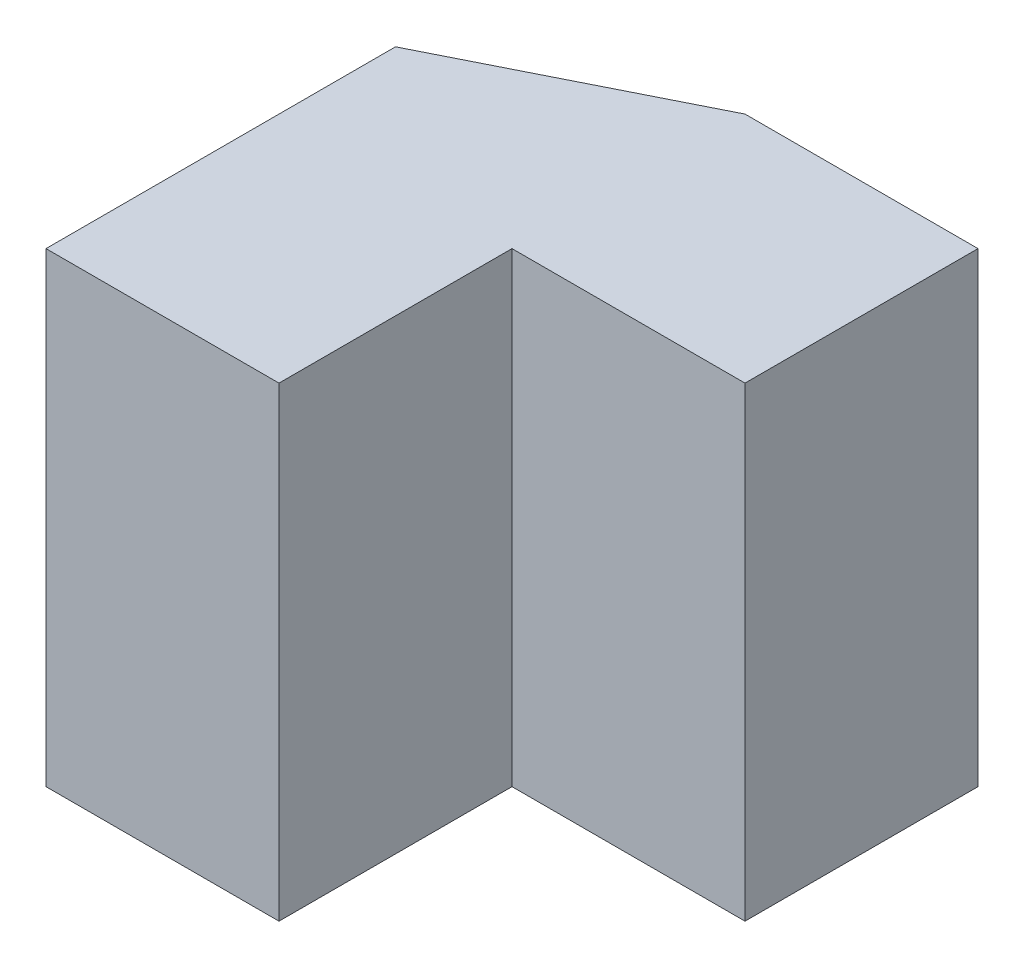
ISO-10303-21;
HEADER;
FILE_DESCRIPTION(('STEP AP214'),'2;1');
FILE_NAME('part.step','',(''),(''),'','','');
FILE_SCHEMA(('AUTOMOTIVE_DESIGN { 1 0 10303 214 1 1 1 1 }'));
ENDSEC;
DATA;
#1=APPLICATION_CONTEXT('core data for automotive mechanical design processes');
#2=APPLICATION_PROTOCOL_DEFINITION('international standard','automotive_design',2000,#1);
#3=PRODUCT_CONTEXT('',#1,'mechanical');
#4=PRODUCT('Part','Part','',(#3));
#5=PRODUCT_RELATED_PRODUCT_CATEGORY('part','',(#4));
#6=PRODUCT_DEFINITION_FORMATION('','',#4);
#7=PRODUCT_DEFINITION_CONTEXT('part definition',#1,'design');
#8=PRODUCT_DEFINITION('design','',#6,#7);
#9=PRODUCT_DEFINITION_SHAPE('','',#8);
#10=(LENGTH_UNIT() NAMED_UNIT(*) SI_UNIT(.MILLI.,.METRE.));
#11=(NAMED_UNIT(*) PLANE_ANGLE_UNIT() SI_UNIT($,.RADIAN.));
#12=(NAMED_UNIT(*) SI_UNIT($,.STERADIAN.) SOLID_ANGLE_UNIT());
#13=UNCERTAINTY_MEASURE_WITH_UNIT(LENGTH_MEASURE(1.E-05),#10,'distance_accuracy_value','');
#14=(GEOMETRIC_REPRESENTATION_CONTEXT(3) GLOBAL_UNCERTAINTY_ASSIGNED_CONTEXT((#13)) GLOBAL_UNIT_ASSIGNED_CONTEXT((#10,
#11,#12)) REPRESENTATION_CONTEXT('',''));
#15=CARTESIAN_POINT('',(0.,0.,0.));
#16=DIRECTION('',(0.,0.,1.));
#17=DIRECTION('',(1.,0.,0.));
#18=AXIS2_PLACEMENT_3D('',#15,#16,#17);
#19=CARTESIAN_POINT('',(0.,0.,20.));
#20=DIRECTION('',(1.,0.,0.));
#21=DIRECTION('',(0.,0.,-1.));
#22=AXIS2_PLACEMENT_3D('',#19,#20,#21);
#23=PLANE('',#22);
#24=DIRECTION('',(0.,0.,-1.));
#25=VECTOR('',#24,1.);
#26=CARTESIAN_POINT('',(0.,20.,20.));
#27=LINE('',#26,#25);
#28=CARTESIAN_POINT('',(0.,20.,20.));
#29=VERTEX_POINT('',#28);
#30=CARTESIAN_POINT('',(0.,20.,5.));
#31=VERTEX_POINT('',#30);
#32=EDGE_CURVE('E102',#29,#31,#27,.T.);
#33=ORIENTED_EDGE('',*,*,#32,.T.);
#34=DIRECTION('',(0.,1.,0.));
#35=VECTOR('',#34,1.);
#36=CARTESIAN_POINT('',(0.,0.,5.));
#37=LINE('',#36,#35);
#38=CARTESIAN_POINT('',(0.,0.,5.));
#39=VERTEX_POINT('',#38);
#40=EDGE_CURVE('E92',#39,#31,#37,.T.);
#41=ORIENTED_EDGE('',*,*,#40,.F.);
#42=DIRECTION('',(0.,0.,-1.));
#43=VECTOR('',#42,1.);
#44=CARTESIAN_POINT('',(0.,0.,20.));
#45=LINE('',#44,#43);
#46=CARTESIAN_POINT('',(0.,0.,20.));
#47=VERTEX_POINT('',#46);
#48=EDGE_CURVE('E11',#47,#39,#45,.T.);
#49=ORIENTED_EDGE('',*,*,#48,.F.);
#50=DIRECTION('',(0.,-1.,0.));
#51=VECTOR('',#50,1.);
#52=CARTESIAN_POINT('',(0.,0.,20.));
#53=LINE('',#52,#51);
#54=EDGE_CURVE('E114',#29,#47,#53,.T.);
#55=ORIENTED_EDGE('',*,*,#54,.F.);
#56=EDGE_LOOP('',(#33,#41,#49,#55));
#57=FACE_BOUND('',#56,.T.);
#58=ADVANCED_FACE('F33',(#57),#23,.F.);
#59=CARTESIAN_POINT('',(0.,0.,20.));
#60=DIRECTION('',(0.,1.,0.));
#61=DIRECTION('',(0.,0.,1.));
#62=AXIS2_PLACEMENT_3D('',#59,#60,#61);
#63=PLANE('',#62);
#64=ORIENTED_EDGE('',*,*,#48,.T.);
#65=DIRECTION('',(0.894427190999916,0.,-0.447213595499958));
#66=VECTOR('',#65,1.);
#67=CARTESIAN_POINT('',(10.,0.,0.));
#68=LINE('',#67,#66);
#69=CARTESIAN_POINT('',(10.,0.,0.));
#70=VERTEX_POINT('',#69);
#71=EDGE_CURVE('E89',#39,#70,#68,.T.);
#72=ORIENTED_EDGE('',*,*,#71,.T.);
#73=DIRECTION('',(1.,0.,0.));
#74=VECTOR('',#73,1.);
#75=CARTESIAN_POINT('',(0.,0.,0.));
#76=LINE('',#75,#74);
#77=CARTESIAN_POINT('',(20.,0.,0.));
#78=VERTEX_POINT('',#77);
#79=EDGE_CURVE('E128',#70,#78,#76,.T.);
#80=ORIENTED_EDGE('',*,*,#79,.T.);
#81=DIRECTION('',(0.,0.,-1.));
#82=VECTOR('',#81,1.);
#83=CARTESIAN_POINT('',(20.,0.,20.));
#84=LINE('',#83,#82);
#85=CARTESIAN_POINT('',(20.,0.,10.));
#86=VERTEX_POINT('',#85);
#87=EDGE_CURVE('E40',#86,#78,#84,.T.);
#88=ORIENTED_EDGE('',*,*,#87,.F.);
#89=DIRECTION('',(-1.,0.,0.));
#90=VECTOR('',#89,1.);
#91=CARTESIAN_POINT('',(20.,0.,10.));
#92=LINE('',#91,#90);
#93=CARTESIAN_POINT('',(10.,0.,10.));
#94=VERTEX_POINT('',#93);
#95=EDGE_CURVE('E152',#86,#94,#92,.T.);
#96=ORIENTED_EDGE('',*,*,#95,.T.);
#97=DIRECTION('',(0.,0.,1.));
#98=VECTOR('',#97,1.);
#99=CARTESIAN_POINT('',(10.,0.,20.));
#100=LINE('',#99,#98);
#101=CARTESIAN_POINT('',(10.,0.,20.));
#102=VERTEX_POINT('',#101);
#103=EDGE_CURVE('E111',#94,#102,#100,.T.);
#104=ORIENTED_EDGE('',*,*,#103,.T.);
#105=DIRECTION('',(1.,0.,0.));
#106=VECTOR('',#105,1.);
#107=CARTESIAN_POINT('',(0.,0.,20.));
#108=LINE('',#107,#106);
#109=EDGE_CURVE('E107',#47,#102,#108,.T.);
#110=ORIENTED_EDGE('',*,*,#109,.F.);
#111=EDGE_LOOP('',(#64,#72,#80,#88,#96,#104,#110));
#112=FACE_BOUND('',#111,.T.);
#113=ADVANCED_FACE('F104',(#112),#63,.F.);
#114=CARTESIAN_POINT('',(20.,0.,20.));
#115=DIRECTION('',(-1.,0.,0.));
#116=DIRECTION('',(0.,0.,1.));
#117=AXIS2_PLACEMENT_3D('',#114,#115,#116);
#118=PLANE('',#117);
#119=DIRECTION('',(0.,0.,-1.));
#120=VECTOR('',#119,1.);
#121=CARTESIAN_POINT('',(20.,20.,20.));
#122=LINE('',#121,#120);
#123=CARTESIAN_POINT('',(20.,20.,10.));
#124=VERTEX_POINT('',#123);
#125=CARTESIAN_POINT('',(20.,20.,0.));
#126=VERTEX_POINT('',#125);
#127=EDGE_CURVE('E134',#124,#126,#122,.T.);
#128=ORIENTED_EDGE('',*,*,#127,.F.);
#129=DIRECTION('',(0.,1.,0.));
#130=VECTOR('',#129,1.);
#131=CARTESIAN_POINT('',(20.,0.,10.));
#132=LINE('',#131,#130);
#133=EDGE_CURVE('E124',#86,#124,#132,.T.);
#134=ORIENTED_EDGE('',*,*,#133,.F.);
#135=ORIENTED_EDGE('',*,*,#87,.T.);
#136=DIRECTION('',(0.,1.,0.));
#137=VECTOR('',#136,1.);
#138=CARTESIAN_POINT('',(20.,0.,0.));
#139=LINE('',#138,#137);
#140=EDGE_CURVE('E121',#78,#126,#139,.T.);
#141=ORIENTED_EDGE('',*,*,#140,.T.);
#142=EDGE_LOOP('',(#128,#134,#135,#141));
#143=FACE_BOUND('',#142,.T.);
#144=ADVANCED_FACE('F141',(#143),#118,.F.);
#145=CARTESIAN_POINT('',(0.,20.,20.));
#146=DIRECTION('',(0.,-1.,0.));
#147=DIRECTION('',(0.,0.,-1.));
#148=AXIS2_PLACEMENT_3D('',#145,#146,#147);
#149=PLANE('',#148);
#150=DIRECTION('',(-1.,0.,0.));
#151=VECTOR('',#150,1.);
#152=CARTESIAN_POINT('',(0.,20.,0.));
#153=LINE('',#152,#151);
#154=CARTESIAN_POINT('',(10.,20.,0.));
#155=VERTEX_POINT('',#154);
#156=EDGE_CURVE('E118',#126,#155,#153,.T.);
#157=ORIENTED_EDGE('',*,*,#156,.T.);
#158=DIRECTION('',(0.894427190999916,0.,-0.447213595499958));
#159=VECTOR('',#158,1.);
#160=CARTESIAN_POINT('',(10.,20.,0.));
#161=LINE('',#160,#159);
#162=EDGE_CURVE('E47',#31,#155,#161,.T.);
#163=ORIENTED_EDGE('',*,*,#162,.F.);
#164=ORIENTED_EDGE('',*,*,#32,.F.);
#165=DIRECTION('',(-1.,0.,0.));
#166=VECTOR('',#165,1.);
#167=CARTESIAN_POINT('',(0.,20.,20.));
#168=LINE('',#167,#166);
#169=CARTESIAN_POINT('',(10.,20.,20.));
#170=VERTEX_POINT('',#169);
#171=EDGE_CURVE('E113',#170,#29,#168,.T.);
#172=ORIENTED_EDGE('',*,*,#171,.F.);
#173=DIRECTION('',(0.,0.,1.));
#174=VECTOR('',#173,1.);
#175=CARTESIAN_POINT('',(10.,20.,20.));
#176=LINE('',#175,#174);
#177=CARTESIAN_POINT('',(10.,20.,10.));
#178=VERTEX_POINT('',#177);
#179=EDGE_CURVE('E55',#178,#170,#176,.T.);
#180=ORIENTED_EDGE('',*,*,#179,.F.);
#181=DIRECTION('',(-1.,0.,0.));
#182=VECTOR('',#181,1.);
#183=CARTESIAN_POINT('',(20.,20.,10.));
#184=LINE('',#183,#182);
#185=EDGE_CURVE('E149',#124,#178,#184,.T.);
#186=ORIENTED_EDGE('',*,*,#185,.F.);
#187=ORIENTED_EDGE('',*,*,#127,.T.);
#188=EDGE_LOOP('',(#157,#163,#164,#172,#180,#186,#187));
#189=FACE_BOUND('',#188,.T.);
#190=ADVANCED_FACE('F146',(#189),#149,.F.);
#191=CARTESIAN_POINT('',(0.,0.,20.));
#192=DIRECTION('',(0.,0.,-1.));
#193=DIRECTION('',(-1.,0.,0.));
#194=AXIS2_PLACEMENT_3D('',#191,#192,#193);
#195=PLANE('',#194);
#196=ORIENTED_EDGE('',*,*,#109,.T.);
#197=DIRECTION('',(0.,1.,0.));
#198=VECTOR('',#197,1.);
#199=CARTESIAN_POINT('',(10.,0.,20.));
#200=LINE('',#199,#198);
#201=EDGE_CURVE('E130',#102,#170,#200,.T.);
#202=ORIENTED_EDGE('',*,*,#201,.T.);
#203=ORIENTED_EDGE('',*,*,#171,.T.);
#204=ORIENTED_EDGE('',*,*,#54,.T.);
#205=EDGE_LOOP('',(#196,#202,#203,#204));
#206=FACE_BOUND('',#205,.T.);
#207=ADVANCED_FACE('F116',(#206),#195,.F.);
#208=CARTESIAN_POINT('',(0.,0.,0.));
#209=DIRECTION('',(0.,0.,-1.));
#210=DIRECTION('',(-1.,0.,0.));
#211=AXIS2_PLACEMENT_3D('',#208,#209,#210);
#212=PLANE('',#211);
#213=DIRECTION('',(0.,1.,0.));
#214=VECTOR('',#213,1.);
#215=CARTESIAN_POINT('',(10.,0.,0.));
#216=LINE('',#215,#214);
#217=EDGE_CURVE('E93',#70,#155,#216,.T.);
#218=ORIENTED_EDGE('',*,*,#217,.T.);
#219=ORIENTED_EDGE('',*,*,#156,.F.);
#220=ORIENTED_EDGE('',*,*,#140,.F.);
#221=ORIENTED_EDGE('',*,*,#79,.F.);
#222=EDGE_LOOP('',(#218,#219,#220,#221));
#223=FACE_BOUND('',#222,.T.);
#224=ADVANCED_FACE('F144',(#223),#212,.T.);
#225=CARTESIAN_POINT('',(10.,0.,20.));
#226=DIRECTION('',(-1.,0.,0.));
#227=DIRECTION('',(0.,0.,1.));
#228=AXIS2_PLACEMENT_3D('',#225,#226,#227);
#229=PLANE('',#228);
#230=ORIENTED_EDGE('',*,*,#179,.T.);
#231=ORIENTED_EDGE('',*,*,#201,.F.);
#232=ORIENTED_EDGE('',*,*,#103,.F.);
#233=DIRECTION('',(0.,1.,0.));
#234=VECTOR('',#233,1.);
#235=CARTESIAN_POINT('',(10.,0.,10.));
#236=LINE('',#235,#234);
#237=EDGE_CURVE('E158',#94,#178,#236,.T.);
#238=ORIENTED_EDGE('',*,*,#237,.T.);
#239=EDGE_LOOP('',(#230,#231,#232,#238));
#240=FACE_BOUND('',#239,.T.);
#241=ADVANCED_FACE('F161',(#240),#229,.F.);
#242=CARTESIAN_POINT('',(20.,0.,10.));
#243=DIRECTION('',(0.,0.,-1.));
#244=DIRECTION('',(-1.,0.,0.));
#245=AXIS2_PLACEMENT_3D('',#242,#243,#244);
#246=PLANE('',#245);
#247=ORIENTED_EDGE('',*,*,#185,.T.);
#248=ORIENTED_EDGE('',*,*,#237,.F.);
#249=ORIENTED_EDGE('',*,*,#95,.F.);
#250=ORIENTED_EDGE('',*,*,#133,.T.);
#251=EDGE_LOOP('',(#247,#248,#249,#250));
#252=FACE_BOUND('',#251,.T.);
#253=ADVANCED_FACE('F160',(#252),#246,.F.);
#254=CARTESIAN_POINT('',(10.,0.,0.));
#255=DIRECTION('',(0.447213595499958,0.,0.894427190999916));
#256=DIRECTION('',(0.894427190999916,0.,-0.447213595499958));
#257=AXIS2_PLACEMENT_3D('',#254,#255,#256);
#258=PLANE('',#257);
#259=ORIENTED_EDGE('',*,*,#162,.T.);
#260=ORIENTED_EDGE('',*,*,#217,.F.);
#261=ORIENTED_EDGE('',*,*,#71,.F.);
#262=ORIENTED_EDGE('',*,*,#40,.T.);
#263=EDGE_LOOP('',(#259,#260,#261,#262));
#264=FACE_BOUND('',#263,.T.);
#265=ADVANCED_FACE('F91',(#264),#258,.F.);
#266=CLOSED_SHELL('',(#58,#113,#144,#190,#207,#224,#241,#253,#265));
#267=MANIFOLD_SOLID_BREP('B2',#266);
#268=ADVANCED_BREP_SHAPE_REPRESENTATION('',(#18,#267),#14);
#269=SHAPE_DEFINITION_REPRESENTATION(#9,#268);
ENDSEC;
END-ISO-10303-21;
